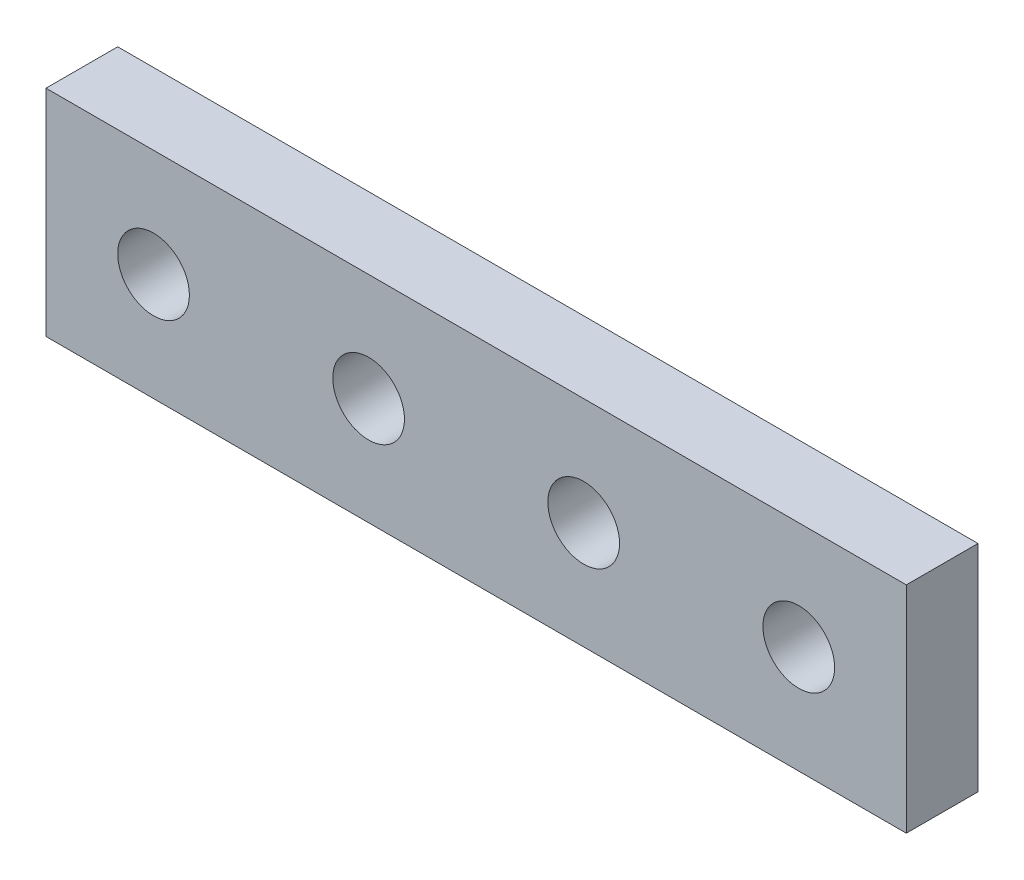
ISO-10303-21;
HEADER;
FILE_DESCRIPTION(('STEP AP214'),'2;1');
FILE_NAME('part.step','',(''),(''),'','','');
FILE_SCHEMA(('AUTOMOTIVE_DESIGN { 1 0 10303 214 1 1 1 1 }'));
ENDSEC;
DATA;
#1=APPLICATION_CONTEXT('core data for automotive mechanical design processes');
#2=APPLICATION_PROTOCOL_DEFINITION('international standard','automotive_design',2000,#1);
#3=PRODUCT_CONTEXT('',#1,'mechanical');
#4=PRODUCT('Part','Part','',(#3));
#5=PRODUCT_RELATED_PRODUCT_CATEGORY('part','',(#4));
#6=PRODUCT_DEFINITION_FORMATION('','',#4);
#7=PRODUCT_DEFINITION_CONTEXT('part definition',#1,'design');
#8=PRODUCT_DEFINITION('design','',#6,#7);
#9=PRODUCT_DEFINITION_SHAPE('','',#8);
#10=(LENGTH_UNIT() NAMED_UNIT(*) SI_UNIT(.MILLI.,.METRE.));
#11=(NAMED_UNIT(*) PLANE_ANGLE_UNIT() SI_UNIT($,.RADIAN.));
#12=(NAMED_UNIT(*) SI_UNIT($,.STERADIAN.) SOLID_ANGLE_UNIT());
#13=UNCERTAINTY_MEASURE_WITH_UNIT(LENGTH_MEASURE(1.E-05),#10,'distance_accuracy_value','');
#14=(GEOMETRIC_REPRESENTATION_CONTEXT(3) GLOBAL_UNCERTAINTY_ASSIGNED_CONTEXT((#13)) GLOBAL_UNIT_ASSIGNED_CONTEXT((#10,
#11,#12)) REPRESENTATION_CONTEXT('',''));
#15=CARTESIAN_POINT('',(0.,0.,0.));
#16=DIRECTION('',(0.,0.,1.));
#17=DIRECTION('',(1.,0.,0.));
#18=AXIS2_PLACEMENT_3D('',#15,#16,#17);
#19=CARTESIAN_POINT('',(0.,0.,10.));
#20=DIRECTION('',(0.,0.,-1.));
#21=DIRECTION('',(-1.,0.,0.));
#22=AXIS2_PLACEMENT_3D('',#19,#20,#21);
#23=PLANE('',#22);
#24=DIRECTION('',(0.,-1.,0.));
#25=VECTOR('',#24,1.);
#26=CARTESIAN_POINT('',(0.,0.,10.));
#27=LINE('',#26,#25);
#28=CARTESIAN_POINT('',(0.,30.,10.));
#29=VERTEX_POINT('',#28);
#30=CARTESIAN_POINT('',(0.,0.,10.));
#31=VERTEX_POINT('',#30);
#32=EDGE_CURVE('E85',#29,#31,#27,.T.);
#33=ORIENTED_EDGE('',*,*,#32,.T.);
#34=DIRECTION('',(1.,0.,0.));
#35=VECTOR('',#34,1.);
#36=CARTESIAN_POINT('',(0.,0.,10.));
#37=LINE('',#36,#35);
#38=CARTESIAN_POINT('',(120.,0.,10.));
#39=VERTEX_POINT('',#38);
#40=EDGE_CURVE('E80',#31,#39,#37,.T.);
#41=ORIENTED_EDGE('',*,*,#40,.T.);
#42=DIRECTION('',(0.,1.,0.));
#43=VECTOR('',#42,1.);
#44=CARTESIAN_POINT('',(120.,0.,10.));
#45=LINE('',#44,#43);
#46=CARTESIAN_POINT('',(120.,30.,10.));
#47=VERTEX_POINT('',#46);
#48=EDGE_CURVE('E83',#39,#47,#45,.T.);
#49=ORIENTED_EDGE('',*,*,#48,.T.);
#50=DIRECTION('',(-1.,0.,0.));
#51=VECTOR('',#50,1.);
#52=CARTESIAN_POINT('',(0.,30.,10.));
#53=LINE('',#52,#51);
#54=EDGE_CURVE('E50',#47,#29,#53,.T.);
#55=ORIENTED_EDGE('',*,*,#54,.T.);
#56=EDGE_LOOP('',(#33,#41,#49,#55));
#57=FACE_BOUND('',#56,.T.);
#58=CARTESIAN_POINT('',(15.,15.,10.));
#59=DIRECTION('',(0.,0.,1.));
#60=DIRECTION('',(1.,0.,0.));
#61=AXIS2_PLACEMENT_3D('',#58,#59,#60);
#62=CIRCLE('',#61,5.);
#63=CARTESIAN_POINT('',(20.,15.,10.));
#64=VERTEX_POINT('',#63);
#65=EDGE_CURVE('E100',#64,#64,#62,.T.);
#66=ORIENTED_EDGE('',*,*,#65,.F.);
#67=EDGE_LOOP('',(#66));
#68=FACE_BOUND('',#67,.T.);
#69=CARTESIAN_POINT('',(45.,15.,10.));
#70=DIRECTION('',(0.,0.,1.));
#71=DIRECTION('',(1.,0.,0.));
#72=AXIS2_PLACEMENT_3D('',#69,#70,#71);
#73=CIRCLE('',#72,5.);
#74=CARTESIAN_POINT('',(50.,15.,10.));
#75=VERTEX_POINT('',#74);
#76=EDGE_CURVE('E115',#75,#75,#73,.T.);
#77=ORIENTED_EDGE('',*,*,#76,.F.);
#78=EDGE_LOOP('',(#77));
#79=FACE_BOUND('',#78,.T.);
#80=CARTESIAN_POINT('',(75.,15.,10.));
#81=DIRECTION('',(0.,0.,1.));
#82=DIRECTION('',(1.,0.,0.));
#83=AXIS2_PLACEMENT_3D('',#80,#81,#82);
#84=CIRCLE('',#83,5.);
#85=CARTESIAN_POINT('',(80.,15.,10.));
#86=VERTEX_POINT('',#85);
#87=EDGE_CURVE('E121',#86,#86,#84,.T.);
#88=ORIENTED_EDGE('',*,*,#87,.F.);
#89=EDGE_LOOP('',(#88));
#90=FACE_BOUND('',#89,.T.);
#91=CARTESIAN_POINT('',(105.,15.,10.));
#92=DIRECTION('',(0.,0.,1.));
#93=DIRECTION('',(1.,0.,0.));
#94=AXIS2_PLACEMENT_3D('',#91,#92,#93);
#95=CIRCLE('',#94,5.);
#96=CARTESIAN_POINT('',(110.,15.,10.));
#97=VERTEX_POINT('',#96);
#98=EDGE_CURVE('E127',#97,#97,#95,.T.);
#99=ORIENTED_EDGE('',*,*,#98,.F.);
#100=EDGE_LOOP('',(#99));
#101=FACE_BOUND('',#100,.T.);
#102=ADVANCED_FACE('F33',(#57,#68,#79,#90,#101),#23,.F.);
#103=CARTESIAN_POINT('',(0.,0.,0.));
#104=DIRECTION('',(0.,0.,-1.));
#105=DIRECTION('',(-1.,0.,0.));
#106=AXIS2_PLACEMENT_3D('',#103,#104,#105);
#107=PLANE('',#106);
#108=CARTESIAN_POINT('',(75.,15.,0.));
#109=DIRECTION('',(0.,0.,1.));
#110=DIRECTION('',(1.,0.,0.));
#111=AXIS2_PLACEMENT_3D('',#108,#109,#110);
#112=CIRCLE('',#111,5.);
#113=CARTESIAN_POINT('',(80.,15.,0.));
#114=VERTEX_POINT('',#113);
#115=EDGE_CURVE('E124',#114,#114,#112,.T.);
#116=ORIENTED_EDGE('',*,*,#115,.T.);
#117=EDGE_LOOP('',(#116));
#118=FACE_BOUND('',#117,.T.);
#119=CARTESIAN_POINT('',(15.,15.,0.));
#120=DIRECTION('',(0.,0.,1.));
#121=DIRECTION('',(1.,0.,0.));
#122=AXIS2_PLACEMENT_3D('',#119,#120,#121);
#123=CIRCLE('',#122,5.);
#124=CARTESIAN_POINT('',(20.,15.,0.));
#125=VERTEX_POINT('',#124);
#126=EDGE_CURVE('E112',#125,#125,#123,.T.);
#127=ORIENTED_EDGE('',*,*,#126,.T.);
#128=EDGE_LOOP('',(#127));
#129=FACE_BOUND('',#128,.T.);
#130=DIRECTION('',(0.,-1.,0.));
#131=VECTOR('',#130,1.);
#132=CARTESIAN_POINT('',(0.,0.,0.));
#133=LINE('',#132,#131);
#134=CARTESIAN_POINT('',(0.,30.,0.));
#135=VERTEX_POINT('',#134);
#136=CARTESIAN_POINT('',(0.,0.,0.));
#137=VERTEX_POINT('',#136);
#138=EDGE_CURVE('E97',#135,#137,#133,.T.);
#139=ORIENTED_EDGE('',*,*,#138,.F.);
#140=DIRECTION('',(-1.,0.,0.));
#141=VECTOR('',#140,1.);
#142=CARTESIAN_POINT('',(0.,30.,0.));
#143=LINE('',#142,#141);
#144=CARTESIAN_POINT('',(120.,30.,0.));
#145=VERTEX_POINT('',#144);
#146=EDGE_CURVE('E73',#145,#135,#143,.T.);
#147=ORIENTED_EDGE('',*,*,#146,.F.);
#148=DIRECTION('',(0.,1.,0.));
#149=VECTOR('',#148,1.);
#150=CARTESIAN_POINT('',(120.,0.,0.));
#151=LINE('',#150,#149);
#152=CARTESIAN_POINT('',(120.,0.,0.));
#153=VERTEX_POINT('',#152);
#154=EDGE_CURVE('E67',#153,#145,#151,.T.);
#155=ORIENTED_EDGE('',*,*,#154,.F.);
#156=DIRECTION('',(1.,0.,0.));
#157=VECTOR('',#156,1.);
#158=CARTESIAN_POINT('',(0.,0.,0.));
#159=LINE('',#158,#157);
#160=EDGE_CURVE('E89',#137,#153,#159,.T.);
#161=ORIENTED_EDGE('',*,*,#160,.F.);
#162=EDGE_LOOP('',(#139,#147,#155,#161));
#163=FACE_BOUND('',#162,.T.);
#164=CARTESIAN_POINT('',(45.,15.,0.));
#165=DIRECTION('',(0.,0.,1.));
#166=DIRECTION('',(1.,0.,0.));
#167=AXIS2_PLACEMENT_3D('',#164,#165,#166);
#168=CIRCLE('',#167,5.);
#169=CARTESIAN_POINT('',(50.,15.,0.));
#170=VERTEX_POINT('',#169);
#171=EDGE_CURVE('E118',#170,#170,#168,.T.);
#172=ORIENTED_EDGE('',*,*,#171,.T.);
#173=EDGE_LOOP('',(#172));
#174=FACE_BOUND('',#173,.T.);
#175=CARTESIAN_POINT('',(105.,15.,0.));
#176=DIRECTION('',(0.,0.,1.));
#177=DIRECTION('',(1.,0.,0.));
#178=AXIS2_PLACEMENT_3D('',#175,#176,#177);
#179=CIRCLE('',#178,5.);
#180=CARTESIAN_POINT('',(110.,15.,0.));
#181=VERTEX_POINT('',#180);
#182=EDGE_CURVE('E130',#181,#181,#179,.T.);
#183=ORIENTED_EDGE('',*,*,#182,.T.);
#184=EDGE_LOOP('',(#183));
#185=FACE_BOUND('',#184,.T.);
#186=ADVANCED_FACE('F108',(#118,#129,#163,#174,#185),#107,.T.);
#187=CARTESIAN_POINT('',(0.,0.,10.));
#188=DIRECTION('',(1.,0.,0.));
#189=DIRECTION('',(0.,0.,-1.));
#190=AXIS2_PLACEMENT_3D('',#187,#188,#189);
#191=PLANE('',#190);
#192=ORIENTED_EDGE('',*,*,#138,.T.);
#193=DIRECTION('',(0.,0.,-1.));
#194=VECTOR('',#193,1.);
#195=CARTESIAN_POINT('',(0.,0.,10.));
#196=LINE('',#195,#194);
#197=EDGE_CURVE('E11',#31,#137,#196,.T.);
#198=ORIENTED_EDGE('',*,*,#197,.F.);
#199=ORIENTED_EDGE('',*,*,#32,.F.);
#200=DIRECTION('',(0.,0.,-1.));
#201=VECTOR('',#200,1.);
#202=CARTESIAN_POINT('',(0.,30.,10.));
#203=LINE('',#202,#201);
#204=EDGE_CURVE('E93',#29,#135,#203,.T.);
#205=ORIENTED_EDGE('',*,*,#204,.T.);
#206=EDGE_LOOP('',(#192,#198,#199,#205));
#207=FACE_BOUND('',#206,.T.);
#208=ADVANCED_FACE('F35',(#207),#191,.F.);
#209=CARTESIAN_POINT('',(0.,0.,10.));
#210=DIRECTION('',(0.,1.,0.));
#211=DIRECTION('',(0.,0.,1.));
#212=AXIS2_PLACEMENT_3D('',#209,#210,#211);
#213=PLANE('',#212);
#214=ORIENTED_EDGE('',*,*,#160,.T.);
#215=DIRECTION('',(0.,0.,-1.));
#216=VECTOR('',#215,1.);
#217=CARTESIAN_POINT('',(120.,0.,10.));
#218=LINE('',#217,#216);
#219=EDGE_CURVE('E42',#39,#153,#218,.T.);
#220=ORIENTED_EDGE('',*,*,#219,.F.);
#221=ORIENTED_EDGE('',*,*,#40,.F.);
#222=ORIENTED_EDGE('',*,*,#197,.T.);
#223=EDGE_LOOP('',(#214,#220,#221,#222));
#224=FACE_BOUND('',#223,.T.);
#225=ADVANCED_FACE('F88',(#224),#213,.F.);
#226=CARTESIAN_POINT('',(120.,0.,10.));
#227=DIRECTION('',(-1.,0.,0.));
#228=DIRECTION('',(0.,0.,1.));
#229=AXIS2_PLACEMENT_3D('',#226,#227,#228);
#230=PLANE('',#229);
#231=ORIENTED_EDGE('',*,*,#154,.T.);
#232=DIRECTION('',(0.,0.,-1.));
#233=VECTOR('',#232,1.);
#234=CARTESIAN_POINT('',(120.,30.,10.));
#235=LINE('',#234,#233);
#236=EDGE_CURVE('E90',#47,#145,#235,.T.);
#237=ORIENTED_EDGE('',*,*,#236,.F.);
#238=ORIENTED_EDGE('',*,*,#48,.F.);
#239=ORIENTED_EDGE('',*,*,#219,.T.);
#240=EDGE_LOOP('',(#231,#237,#238,#239));
#241=FACE_BOUND('',#240,.T.);
#242=ADVANCED_FACE('F91',(#241),#230,.F.);
#243=CARTESIAN_POINT('',(0.,30.,10.));
#244=DIRECTION('',(0.,-1.,0.));
#245=DIRECTION('',(0.,0.,-1.));
#246=AXIS2_PLACEMENT_3D('',#243,#244,#245);
#247=PLANE('',#246);
#248=ORIENTED_EDGE('',*,*,#146,.T.);
#249=ORIENTED_EDGE('',*,*,#204,.F.);
#250=ORIENTED_EDGE('',*,*,#54,.F.);
#251=ORIENTED_EDGE('',*,*,#236,.T.);
#252=EDGE_LOOP('',(#248,#249,#250,#251));
#253=FACE_BOUND('',#252,.T.);
#254=ADVANCED_FACE('F105',(#253),#247,.F.);
#255=CARTESIAN_POINT('',(15.,15.,10.));
#256=DIRECTION('',(0.,0.,-1.));
#257=DIRECTION('',(-1.,0.,0.));
#258=AXIS2_PLACEMENT_3D('',#255,#256,#257);
#259=CYLINDRICAL_SURFACE('',#258,5.);
#260=ORIENTED_EDGE('',*,*,#65,.T.);
#261=EDGE_LOOP('',(#260));
#262=FACE_BOUND('',#261,.T.);
#263=ORIENTED_EDGE('',*,*,#126,.F.);
#264=EDGE_LOOP('',(#263));
#265=FACE_BOUND('',#264,.T.);
#266=ADVANCED_FACE('F147',(#262,#265),#259,.F.);
#267=CARTESIAN_POINT('',(45.,15.,10.));
#268=DIRECTION('',(0.,0.,-1.));
#269=DIRECTION('',(-1.,0.,0.));
#270=AXIS2_PLACEMENT_3D('',#267,#268,#269);
#271=CYLINDRICAL_SURFACE('',#270,5.);
#272=ORIENTED_EDGE('',*,*,#76,.T.);
#273=EDGE_LOOP('',(#272));
#274=FACE_BOUND('',#273,.T.);
#275=ORIENTED_EDGE('',*,*,#171,.F.);
#276=EDGE_LOOP('',(#275));
#277=FACE_BOUND('',#276,.T.);
#278=ADVANCED_FACE('F193',(#274,#277),#271,.F.);
#279=CARTESIAN_POINT('',(75.,15.,10.));
#280=DIRECTION('',(0.,0.,-1.));
#281=DIRECTION('',(-1.,0.,0.));
#282=AXIS2_PLACEMENT_3D('',#279,#280,#281);
#283=CYLINDRICAL_SURFACE('',#282,5.);
#284=ORIENTED_EDGE('',*,*,#87,.T.);
#285=EDGE_LOOP('',(#284));
#286=FACE_BOUND('',#285,.T.);
#287=ORIENTED_EDGE('',*,*,#115,.F.);
#288=EDGE_LOOP('',(#287));
#289=FACE_BOUND('',#288,.T.);
#290=ADVANCED_FACE('F201',(#286,#289),#283,.F.);
#291=CARTESIAN_POINT('',(105.,15.,10.));
#292=DIRECTION('',(0.,0.,-1.));
#293=DIRECTION('',(-1.,0.,0.));
#294=AXIS2_PLACEMENT_3D('',#291,#292,#293);
#295=CYLINDRICAL_SURFACE('',#294,5.);
#296=ORIENTED_EDGE('',*,*,#98,.T.);
#297=EDGE_LOOP('',(#296));
#298=FACE_BOUND('',#297,.T.);
#299=ORIENTED_EDGE('',*,*,#182,.F.);
#300=EDGE_LOOP('',(#299));
#301=FACE_BOUND('',#300,.T.);
#302=ADVANCED_FACE('F136',(#298,#301),#295,.F.);
#303=CLOSED_SHELL('',(#102,#186,#208,#225,#242,#254,#266,#278,#290,#302));
#304=MANIFOLD_SOLID_BREP('B2',#303);
#305=ADVANCED_BREP_SHAPE_REPRESENTATION('',(#18,#304),#14);
#306=SHAPE_DEFINITION_REPRESENTATION(#9,#305);
ENDSEC;
END-ISO-10303-21;
